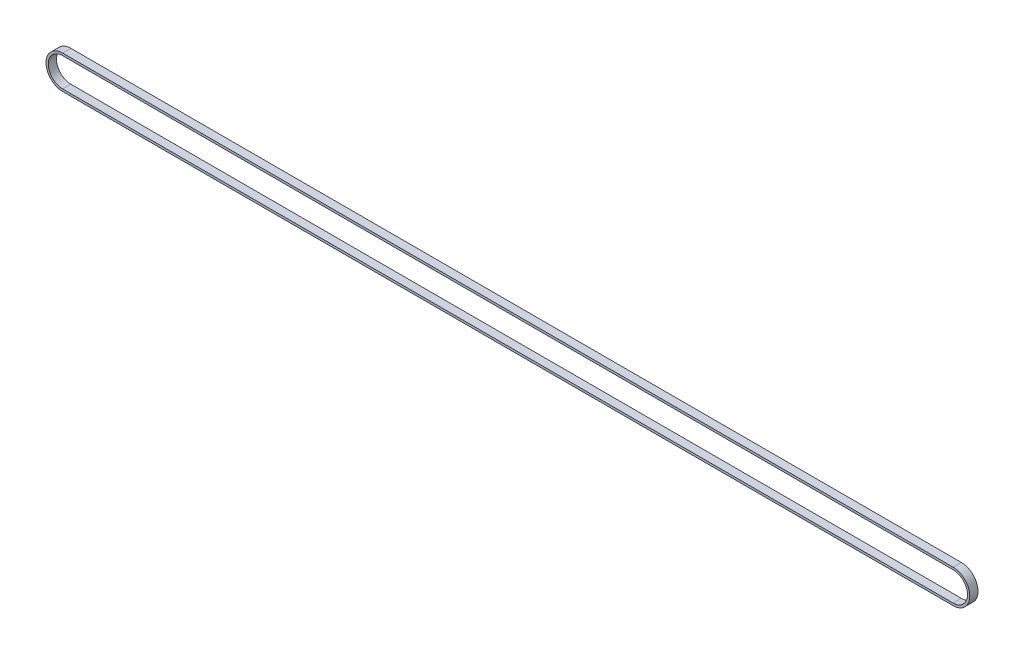
ISO-10303-21;
HEADER;
FILE_DESCRIPTION(('STEP AP214'),'2;1');
FILE_NAME('part.step','',(''),(''),'','','');
FILE_SCHEMA(('AUTOMOTIVE_DESIGN { 1 0 10303 214 1 1 1 1 }'));
ENDSEC;
DATA;
#1=APPLICATION_CONTEXT('core data for automotive mechanical design processes');
#2=APPLICATION_PROTOCOL_DEFINITION('international standard','automotive_design',2000,#1);
#3=PRODUCT_CONTEXT('',#1,'mechanical');
#4=PRODUCT('Part','Part','',(#3));
#5=PRODUCT_RELATED_PRODUCT_CATEGORY('part','',(#4));
#6=PRODUCT_DEFINITION_FORMATION('','',#4);
#7=PRODUCT_DEFINITION_CONTEXT('part definition',#1,'design');
#8=PRODUCT_DEFINITION('design','',#6,#7);
#9=PRODUCT_DEFINITION_SHAPE('','',#8);
#10=(LENGTH_UNIT() NAMED_UNIT(*) SI_UNIT(.MILLI.,.METRE.));
#11=(NAMED_UNIT(*) PLANE_ANGLE_UNIT() SI_UNIT($,.RADIAN.));
#12=(NAMED_UNIT(*) SI_UNIT($,.STERADIAN.) SOLID_ANGLE_UNIT());
#13=UNCERTAINTY_MEASURE_WITH_UNIT(LENGTH_MEASURE(1.E-05),#10,'distance_accuracy_value','');
#14=(GEOMETRIC_REPRESENTATION_CONTEXT(3) GLOBAL_UNCERTAINTY_ASSIGNED_CONTEXT((#13)) GLOBAL_UNIT_ASSIGNED_CONTEXT((#10,
#11,#12)) REPRESENTATION_CONTEXT('',''));
#15=CARTESIAN_POINT('',(0.,0.,0.));
#16=DIRECTION('',(0.,0.,1.));
#17=DIRECTION('',(1.,0.,0.));
#18=AXIS2_PLACEMENT_3D('',#15,#16,#17);
#19=CARTESIAN_POINT('',(0.,0.,2.5));
#20=DIRECTION('',(0.,0.,1.));
#21=DIRECTION('',(1.,0.,0.));
#22=AXIS2_PLACEMENT_3D('',#19,#20,#21);
#23=PLANE('',#22);
#24=CARTESIAN_POINT('',(0.,0.,2.5));
#25=DIRECTION('',(0.,0.,1.));
#26=DIRECTION('',(1.,0.,0.));
#27=AXIS2_PLACEMENT_3D('',#24,#25,#26);
#28=CIRCLE('',#27,10.13);
#29=CARTESIAN_POINT('',(0.,10.13,2.5));
#30=VERTEX_POINT('',#29);
#31=CARTESIAN_POINT('',(0.,-10.13,2.5));
#32=VERTEX_POINT('',#31);
#33=EDGE_CURVE('E157',#30,#32,#28,.T.);
#34=ORIENTED_EDGE('',*,*,#33,.T.);
#35=DIRECTION('',(1.,0.,0.));
#36=VECTOR('',#35,1.);
#37=CARTESIAN_POINT('',(541.,-10.13,2.5));
#38=LINE('',#37,#36);
#39=CARTESIAN_POINT('',(541.,-10.13,2.5));
#40=VERTEX_POINT('',#39);
#41=EDGE_CURVE('E160',#32,#40,#38,.T.);
#42=ORIENTED_EDGE('',*,*,#41,.T.);
#43=CARTESIAN_POINT('',(541.,0.,2.5));
#44=DIRECTION('',(0.,0.,1.));
#45=DIRECTION('',(1.,0.,0.));
#46=AXIS2_PLACEMENT_3D('',#43,#44,#45);
#47=CIRCLE('',#46,10.13);
#48=CARTESIAN_POINT('',(541.,10.13,2.5));
#49=VERTEX_POINT('',#48);
#50=EDGE_CURVE('E163',#40,#49,#47,.T.);
#51=ORIENTED_EDGE('',*,*,#50,.T.);
#52=DIRECTION('',(-1.,0.,0.));
#53=VECTOR('',#52,1.);
#54=CARTESIAN_POINT('',(0.,10.13,2.5));
#55=LINE('',#54,#53);
#56=EDGE_CURVE('E165',#49,#30,#55,.T.);
#57=ORIENTED_EDGE('',*,*,#56,.T.);
#58=EDGE_LOOP('',(#34,#42,#51,#57));
#59=FACE_BOUND('',#58,.T.);
#60=DIRECTION('',(1.,0.,0.));
#61=VECTOR('',#60,1.);
#62=CARTESIAN_POINT('',(541.,-8.75,2.5));
#63=LINE('',#62,#61);
#64=CARTESIAN_POINT('',(0.,-8.75,2.5));
#65=VERTEX_POINT('',#64);
#66=CARTESIAN_POINT('',(541.,-8.75,2.5));
#67=VERTEX_POINT('',#66);
#68=EDGE_CURVE('E129',#65,#67,#63,.T.);
#69=ORIENTED_EDGE('',*,*,#68,.F.);
#70=CARTESIAN_POINT('',(0.,0.,2.5));
#71=DIRECTION('',(0.,0.,1.));
#72=DIRECTION('',(1.,0.,0.));
#73=AXIS2_PLACEMENT_3D('',#70,#71,#72);
#74=CIRCLE('',#73,8.75);
#75=CARTESIAN_POINT('',(0.,8.75,2.5));
#76=VERTEX_POINT('',#75);
#77=EDGE_CURVE('E121',#76,#65,#74,.T.);
#78=ORIENTED_EDGE('',*,*,#77,.F.);
#79=DIRECTION('',(-1.,0.,0.));
#80=VECTOR('',#79,1.);
#81=CARTESIAN_POINT('',(0.,8.75,2.5));
#82=LINE('',#81,#80);
#83=CARTESIAN_POINT('',(541.,8.75,2.5));
#84=VERTEX_POINT('',#83);
#85=EDGE_CURVE('E143',#84,#76,#82,.T.);
#86=ORIENTED_EDGE('',*,*,#85,.F.);
#87=CARTESIAN_POINT('',(541.,0.,2.5));
#88=DIRECTION('',(0.,0.,1.));
#89=DIRECTION('',(1.,0.,0.));
#90=AXIS2_PLACEMENT_3D('',#87,#88,#89);
#91=CIRCLE('',#90,8.75);
#92=EDGE_CURVE('E141',#67,#84,#91,.T.);
#93=ORIENTED_EDGE('',*,*,#92,.F.);
#94=EDGE_LOOP('',(#69,#78,#86,#93));
#95=FACE_BOUND('',#94,.T.);
#96=ADVANCED_FACE('F56',(#59,#95),#23,.T.);
#97=CARTESIAN_POINT('',(0.,0.,-2.5));
#98=DIRECTION('',(0.,0.,1.));
#99=DIRECTION('',(1.,0.,0.));
#100=AXIS2_PLACEMENT_3D('',#97,#98,#99);
#101=PLANE('',#100);
#102=CARTESIAN_POINT('',(0.,0.,-2.5));
#103=DIRECTION('',(0.,0.,1.));
#104=DIRECTION('',(1.,0.,0.));
#105=AXIS2_PLACEMENT_3D('',#102,#103,#104);
#106=CIRCLE('',#105,10.13);
#107=CARTESIAN_POINT('',(0.,10.13,-2.5));
#108=VERTEX_POINT('',#107);
#109=CARTESIAN_POINT('',(0.,-10.13,-2.5));
#110=VERTEX_POINT('',#109);
#111=EDGE_CURVE('E137',#108,#110,#106,.T.);
#112=ORIENTED_EDGE('',*,*,#111,.F.);
#113=DIRECTION('',(-1.,0.,0.));
#114=VECTOR('',#113,1.);
#115=CARTESIAN_POINT('',(0.,10.13,-2.5));
#116=LINE('',#115,#114);
#117=CARTESIAN_POINT('',(541.,10.13,-2.5));
#118=VERTEX_POINT('',#117);
#119=EDGE_CURVE('E161',#118,#108,#116,.T.);
#120=ORIENTED_EDGE('',*,*,#119,.F.);
#121=CARTESIAN_POINT('',(541.,0.,-2.5));
#122=DIRECTION('',(0.,0.,1.));
#123=DIRECTION('',(1.,0.,0.));
#124=AXIS2_PLACEMENT_3D('',#121,#122,#123);
#125=CIRCLE('',#124,10.13);
#126=CARTESIAN_POINT('',(541.,-10.13,-2.5));
#127=VERTEX_POINT('',#126);
#128=EDGE_CURVE('E172',#127,#118,#125,.T.);
#129=ORIENTED_EDGE('',*,*,#128,.F.);
#130=DIRECTION('',(1.,0.,0.));
#131=VECTOR('',#130,1.);
#132=CARTESIAN_POINT('',(541.,-10.13,-2.5));
#133=LINE('',#132,#131);
#134=EDGE_CURVE('E170',#110,#127,#133,.T.);
#135=ORIENTED_EDGE('',*,*,#134,.F.);
#136=EDGE_LOOP('',(#112,#120,#129,#135));
#137=FACE_BOUND('',#136,.T.);
#138=CARTESIAN_POINT('',(0.,0.,-2.5));
#139=DIRECTION('',(0.,0.,1.));
#140=DIRECTION('',(1.,0.,0.));
#141=AXIS2_PLACEMENT_3D('',#138,#139,#140);
#142=CIRCLE('',#141,8.75);
#143=CARTESIAN_POINT('',(0.,8.75,-2.5));
#144=VERTEX_POINT('',#143);
#145=CARTESIAN_POINT('',(0.,-8.75,-2.5));
#146=VERTEX_POINT('',#145);
#147=EDGE_CURVE('E79',#144,#146,#142,.T.);
#148=ORIENTED_EDGE('',*,*,#147,.T.);
#149=DIRECTION('',(1.,0.,0.));
#150=VECTOR('',#149,1.);
#151=CARTESIAN_POINT('',(541.,-8.75,-2.5));
#152=LINE('',#151,#150);
#153=CARTESIAN_POINT('',(541.,-8.75,-2.5));
#154=VERTEX_POINT('',#153);
#155=EDGE_CURVE('E136',#146,#154,#152,.T.);
#156=ORIENTED_EDGE('',*,*,#155,.T.);
#157=CARTESIAN_POINT('',(541.,0.,-2.5));
#158=DIRECTION('',(0.,0.,1.));
#159=DIRECTION('',(1.,0.,0.));
#160=AXIS2_PLACEMENT_3D('',#157,#158,#159);
#161=CIRCLE('',#160,8.75);
#162=CARTESIAN_POINT('',(541.,8.75,-2.5));
#163=VERTEX_POINT('',#162);
#164=EDGE_CURVE('E149',#154,#163,#161,.T.);
#165=ORIENTED_EDGE('',*,*,#164,.T.);
#166=DIRECTION('',(-1.,0.,0.));
#167=VECTOR('',#166,1.);
#168=CARTESIAN_POINT('',(0.,8.75,-2.5));
#169=LINE('',#168,#167);
#170=EDGE_CURVE('E130',#163,#144,#169,.T.);
#171=ORIENTED_EDGE('',*,*,#170,.T.);
#172=EDGE_LOOP('',(#148,#156,#165,#171));
#173=FACE_BOUND('',#172,.T.);
#174=ADVANCED_FACE('F190',(#137,#173),#101,.F.);
#175=CARTESIAN_POINT('',(0.,0.,2.5));
#176=DIRECTION('',(0.,0.,-1.));
#177=DIRECTION('',(-1.,0.,0.));
#178=AXIS2_PLACEMENT_3D('',#175,#176,#177);
#179=CYLINDRICAL_SURFACE('',#178,10.13);
#180=ORIENTED_EDGE('',*,*,#111,.T.);
#181=DIRECTION('',(0.,0.,-1.));
#182=VECTOR('',#181,1.);
#183=CARTESIAN_POINT('',(0.,-10.13,2.5));
#184=LINE('',#183,#182);
#185=EDGE_CURVE('E12',#32,#110,#184,.T.);
#186=ORIENTED_EDGE('',*,*,#185,.F.);
#187=ORIENTED_EDGE('',*,*,#33,.F.);
#188=DIRECTION('',(0.,0.,-1.));
#189=VECTOR('',#188,1.);
#190=CARTESIAN_POINT('',(0.,10.13,2.5));
#191=LINE('',#190,#189);
#192=EDGE_CURVE('E167',#30,#108,#191,.T.);
#193=ORIENTED_EDGE('',*,*,#192,.T.);
#194=EDGE_LOOP('',(#180,#186,#187,#193));
#195=FACE_BOUND('',#194,.T.);
#196=ADVANCED_FACE('F58',(#195),#179,.T.);
#197=CARTESIAN_POINT('',(541.,-10.13,2.5));
#198=DIRECTION('',(0.,1.,0.));
#199=DIRECTION('',(0.,0.,1.));
#200=AXIS2_PLACEMENT_3D('',#197,#198,#199);
#201=PLANE('',#200);
#202=ORIENTED_EDGE('',*,*,#134,.T.);
#203=DIRECTION('',(0.,0.,-1.));
#204=VECTOR('',#203,1.);
#205=CARTESIAN_POINT('',(541.,-10.13,2.5));
#206=LINE('',#205,#204);
#207=EDGE_CURVE('E64',#40,#127,#206,.T.);
#208=ORIENTED_EDGE('',*,*,#207,.F.);
#209=ORIENTED_EDGE('',*,*,#41,.F.);
#210=ORIENTED_EDGE('',*,*,#185,.T.);
#211=EDGE_LOOP('',(#202,#208,#209,#210));
#212=FACE_BOUND('',#211,.T.);
#213=ADVANCED_FACE('F200',(#212),#201,.F.);
#214=CARTESIAN_POINT('',(541.,0.,2.5));
#215=DIRECTION('',(0.,0.,-1.));
#216=DIRECTION('',(-1.,0.,0.));
#217=AXIS2_PLACEMENT_3D('',#214,#215,#216);
#218=CYLINDRICAL_SURFACE('',#217,10.13);
#219=ORIENTED_EDGE('',*,*,#128,.T.);
#220=DIRECTION('',(0.,0.,-1.));
#221=VECTOR('',#220,1.);
#222=CARTESIAN_POINT('',(541.,10.13,2.5));
#223=LINE('',#222,#221);
#224=EDGE_CURVE('E177',#49,#118,#223,.T.);
#225=ORIENTED_EDGE('',*,*,#224,.F.);
#226=ORIENTED_EDGE('',*,*,#50,.F.);
#227=ORIENTED_EDGE('',*,*,#207,.T.);
#228=EDGE_LOOP('',(#219,#225,#226,#227));
#229=FACE_BOUND('',#228,.T.);
#230=ADVANCED_FACE('F184',(#229),#218,.T.);
#231=CARTESIAN_POINT('',(0.,10.13,2.5));
#232=DIRECTION('',(0.,-1.,0.));
#233=DIRECTION('',(0.,0.,-1.));
#234=AXIS2_PLACEMENT_3D('',#231,#232,#233);
#235=PLANE('',#234);
#236=ORIENTED_EDGE('',*,*,#119,.T.);
#237=ORIENTED_EDGE('',*,*,#192,.F.);
#238=ORIENTED_EDGE('',*,*,#56,.F.);
#239=ORIENTED_EDGE('',*,*,#224,.T.);
#240=EDGE_LOOP('',(#236,#237,#238,#239));
#241=FACE_BOUND('',#240,.T.);
#242=ADVANCED_FACE('F194',(#241),#235,.F.);
#243=CARTESIAN_POINT('',(0.,0.,2.5));
#244=DIRECTION('',(0.,0.,-1.));
#245=DIRECTION('',(-1.,0.,0.));
#246=AXIS2_PLACEMENT_3D('',#243,#244,#245);
#247=CYLINDRICAL_SURFACE('',#246,8.75);
#248=ORIENTED_EDGE('',*,*,#147,.F.);
#249=DIRECTION('',(0.,0.,-1.));
#250=VECTOR('',#249,1.);
#251=CARTESIAN_POINT('',(0.,8.75,2.5));
#252=LINE('',#251,#250);
#253=EDGE_CURVE('E125',#76,#144,#252,.T.);
#254=ORIENTED_EDGE('',*,*,#253,.F.);
#255=ORIENTED_EDGE('',*,*,#77,.T.);
#256=DIRECTION('',(0.,0.,-1.));
#257=VECTOR('',#256,1.);
#258=CARTESIAN_POINT('',(0.,-8.75,2.5));
#259=LINE('',#258,#257);
#260=EDGE_CURVE('E124',#65,#146,#259,.T.);
#261=ORIENTED_EDGE('',*,*,#260,.T.);
#262=EDGE_LOOP('',(#248,#254,#255,#261));
#263=FACE_BOUND('',#262,.T.);
#264=ADVANCED_FACE('F123',(#263),#247,.F.);
#265=CARTESIAN_POINT('',(541.,-8.75,2.5));
#266=DIRECTION('',(0.,1.,0.));
#267=DIRECTION('',(0.,0.,1.));
#268=AXIS2_PLACEMENT_3D('',#265,#266,#267);
#269=PLANE('',#268);
#270=ORIENTED_EDGE('',*,*,#155,.F.);
#271=ORIENTED_EDGE('',*,*,#260,.F.);
#272=ORIENTED_EDGE('',*,*,#68,.T.);
#273=DIRECTION('',(0.,0.,-1.));
#274=VECTOR('',#273,1.);
#275=CARTESIAN_POINT('',(541.,-8.75,2.5));
#276=LINE('',#275,#274);
#277=EDGE_CURVE('E138',#67,#154,#276,.T.);
#278=ORIENTED_EDGE('',*,*,#277,.T.);
#279=EDGE_LOOP('',(#270,#271,#272,#278));
#280=FACE_BOUND('',#279,.T.);
#281=ADVANCED_FACE('F133',(#280),#269,.T.);
#282=CARTESIAN_POINT('',(541.,0.,2.5));
#283=DIRECTION('',(0.,0.,-1.));
#284=DIRECTION('',(-1.,0.,0.));
#285=AXIS2_PLACEMENT_3D('',#282,#283,#284);
#286=CYLINDRICAL_SURFACE('',#285,8.75);
#287=ORIENTED_EDGE('',*,*,#164,.F.);
#288=ORIENTED_EDGE('',*,*,#277,.F.);
#289=ORIENTED_EDGE('',*,*,#92,.T.);
#290=DIRECTION('',(0.,0.,-1.));
#291=VECTOR('',#290,1.);
#292=CARTESIAN_POINT('',(541.,8.75,2.5));
#293=LINE('',#292,#291);
#294=EDGE_CURVE('E71',#84,#163,#293,.T.);
#295=ORIENTED_EDGE('',*,*,#294,.T.);
#296=EDGE_LOOP('',(#287,#288,#289,#295));
#297=FACE_BOUND('',#296,.T.);
#298=ADVANCED_FACE('F223',(#297),#286,.F.);
#299=CARTESIAN_POINT('',(0.,8.75,2.5));
#300=DIRECTION('',(0.,-1.,0.));
#301=DIRECTION('',(0.,0.,-1.));
#302=AXIS2_PLACEMENT_3D('',#299,#300,#301);
#303=PLANE('',#302);
#304=ORIENTED_EDGE('',*,*,#170,.F.);
#305=ORIENTED_EDGE('',*,*,#294,.F.);
#306=ORIENTED_EDGE('',*,*,#85,.T.);
#307=ORIENTED_EDGE('',*,*,#253,.T.);
#308=EDGE_LOOP('',(#304,#305,#306,#307));
#309=FACE_BOUND('',#308,.T.);
#310=ADVANCED_FACE('F227',(#309),#303,.T.);
#311=CLOSED_SHELL('',(#96,#174,#196,#213,#230,#242,#264,#281,#298,#310));
#312=MANIFOLD_SOLID_BREP('B2',#311);
#313=ADVANCED_BREP_SHAPE_REPRESENTATION('',(#18,#312),#14);
#314=SHAPE_DEFINITION_REPRESENTATION(#9,#313);
ENDSEC;
END-ISO-10303-21;
